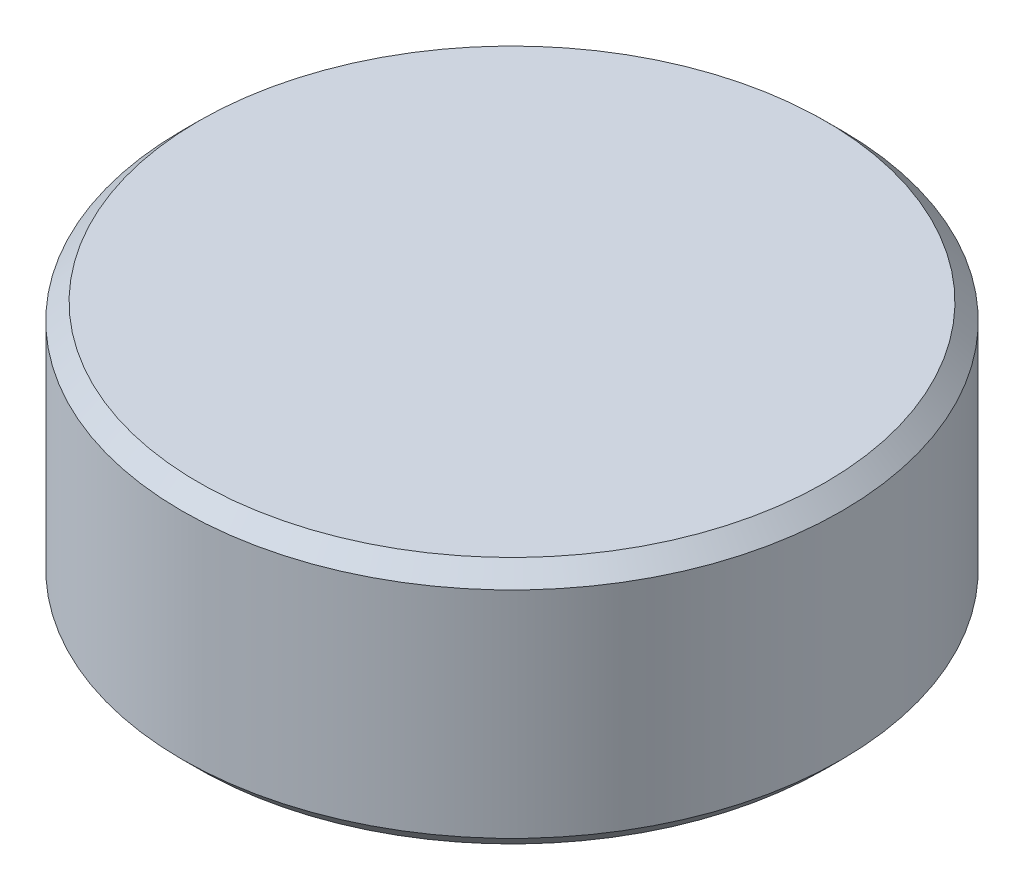
ISO-10303-21;
HEADER;
FILE_DESCRIPTION(('STEP AP214'),'2;1');
FILE_NAME('part.step','',(''),(''),'','','');
FILE_SCHEMA(('AUTOMOTIVE_DESIGN { 1 0 10303 214 1 1 1 1 }'));
ENDSEC;
DATA;
#1=APPLICATION_CONTEXT('core data for automotive mechanical design processes');
#2=APPLICATION_PROTOCOL_DEFINITION('international standard','automotive_design',2000,#1);
#3=PRODUCT_CONTEXT('',#1,'mechanical');
#4=PRODUCT('Part','Part','',(#3));
#5=PRODUCT_RELATED_PRODUCT_CATEGORY('part','',(#4));
#6=PRODUCT_DEFINITION_FORMATION('','',#4);
#7=PRODUCT_DEFINITION_CONTEXT('part definition',#1,'design');
#8=PRODUCT_DEFINITION('design','',#6,#7);
#9=PRODUCT_DEFINITION_SHAPE('','',#8);
#10=(LENGTH_UNIT() NAMED_UNIT(*) SI_UNIT(.MILLI.,.METRE.));
#11=(NAMED_UNIT(*) PLANE_ANGLE_UNIT() SI_UNIT($,.RADIAN.));
#12=(NAMED_UNIT(*) SI_UNIT($,.STERADIAN.) SOLID_ANGLE_UNIT());
#13=UNCERTAINTY_MEASURE_WITH_UNIT(LENGTH_MEASURE(1.E-05),#10,'distance_accuracy_value','');
#14=(GEOMETRIC_REPRESENTATION_CONTEXT(3) GLOBAL_UNCERTAINTY_ASSIGNED_CONTEXT((#13)) GLOBAL_UNIT_ASSIGNED_CONTEXT((#10,
#11,#12)) REPRESENTATION_CONTEXT('',''));
#15=CARTESIAN_POINT('',(0.,0.,0.));
#16=DIRECTION('',(0.,0.,1.));
#17=DIRECTION('',(1.,0.,0.));
#18=AXIS2_PLACEMENT_3D('',#15,#16,#17);
#19=CARTESIAN_POINT('',(0.,-5.375,284.8));
#20=DIRECTION('',(0.,-1.,0.));
#21=DIRECTION('',(0.,0.,1.));
#22=AXIS2_PLACEMENT_3D('',#19,#20,#21);
#23=PLANE('',#22);
#24=CARTESIAN_POINT('',(0.,-5.375,284.8));
#25=DIRECTION('',(0.,1.,0.));
#26=DIRECTION('',(1.,0.,0.));
#27=AXIS2_PLACEMENT_3D('',#24,#25,#26);
#28=CIRCLE('',#27,38.);
#29=CARTESIAN_POINT('',(38.,-5.375,284.8));
#30=VERTEX_POINT('',#29);
#31=EDGE_CURVE('E48',#30,#30,#28,.T.);
#32=ORIENTED_EDGE('',*,*,#31,.T.);
#33=EDGE_LOOP('',(#32));
#34=FACE_BOUND('',#33,.T.);
#35=ADVANCED_FACE('F17',(#34),#23,.F.);
#36=CARTESIAN_POINT('',(0.,-35.475,284.8));
#37=DIRECTION('',(0.,-1.,0.));
#38=DIRECTION('',(0.,0.,1.));
#39=AXIS2_PLACEMENT_3D('',#36,#37,#38);
#40=PLANE('',#39);
#41=CARTESIAN_POINT('',(0.,-35.475,284.8));
#42=DIRECTION('',(0.,-1.,0.));
#43=DIRECTION('',(1.,0.,0.));
#44=AXIS2_PLACEMENT_3D('',#41,#42,#43);
#45=CIRCLE('',#44,38.);
#46=CARTESIAN_POINT('',(-38.,-35.475,284.8));
#47=VERTEX_POINT('',#46);
#48=EDGE_CURVE('E28',#47,#47,#45,.T.);
#49=ORIENTED_EDGE('',*,*,#48,.T.);
#50=EDGE_LOOP('',(#49));
#51=FACE_BOUND('',#50,.T.);
#52=ADVANCED_FACE('F81',(#51),#40,.T.);
#53=CARTESIAN_POINT('',(0.,-35.475,284.8));
#54=DIRECTION('',(0.,1.,0.));
#55=DIRECTION('',(-1.,0.,0.));
#56=AXIS2_PLACEMENT_3D('',#53,#54,#55);
#57=CYLINDRICAL_SURFACE('',#56,40.);
#58=CARTESIAN_POINT('',(0.,-7.375,284.8));
#59=DIRECTION('',(0.,-1.,0.));
#60=DIRECTION('',(1.,0.,0.));
#61=AXIS2_PLACEMENT_3D('',#58,#59,#60);
#62=CIRCLE('',#61,40.);
#63=CARTESIAN_POINT('',(40.,-7.375,284.8));
#64=VERTEX_POINT('',#63);
#65=EDGE_CURVE('E21',#64,#64,#62,.T.);
#66=ORIENTED_EDGE('',*,*,#65,.T.);
#67=EDGE_LOOP('',(#66));
#68=FACE_BOUND('',#67,.T.);
#69=CARTESIAN_POINT('',(0.,-33.475,284.8));
#70=DIRECTION('',(0.,1.,0.));
#71=DIRECTION('',(1.,0.,0.));
#72=AXIS2_PLACEMENT_3D('',#69,#70,#71);
#73=CIRCLE('',#72,40.);
#74=CARTESIAN_POINT('',(-40.,-33.475,284.8));
#75=VERTEX_POINT('',#74);
#76=EDGE_CURVE('E11',#75,#75,#73,.T.);
#77=ORIENTED_EDGE('',*,*,#76,.T.);
#78=EDGE_LOOP('',(#77));
#79=FACE_BOUND('',#78,.T.);
#80=ADVANCED_FACE('F56',(#68,#79),#57,.T.);
#81=CARTESIAN_POINT('',(0.,-35.475,284.8));
#82=DIRECTION('',(0.,1.,0.));
#83=DIRECTION('',(-1.,0.,0.));
#84=AXIS2_PLACEMENT_3D('',#81,#82,#83);
#85=CONICAL_SURFACE('',#84,38.,0.785398163397448);
#86=ORIENTED_EDGE('',*,*,#76,.F.);
#87=EDGE_LOOP('',(#86));
#88=FACE_BOUND('',#87,.T.);
#89=ORIENTED_EDGE('',*,*,#48,.F.);
#90=EDGE_LOOP('',(#89));
#91=FACE_BOUND('',#90,.T.);
#92=ADVANCED_FACE('F19',(#88,#91),#85,.T.);
#93=CARTESIAN_POINT('',(0.,-7.375,284.8));
#94=DIRECTION('',(0.,-1.,0.));
#95=DIRECTION('',(1.,0.,0.));
#96=AXIS2_PLACEMENT_3D('',#93,#94,#95);
#97=CONICAL_SURFACE('',#96,40.,0.785398163397448);
#98=ORIENTED_EDGE('',*,*,#65,.F.);
#99=EDGE_LOOP('',(#98));
#100=FACE_BOUND('',#99,.T.);
#101=ORIENTED_EDGE('',*,*,#31,.F.);
#102=EDGE_LOOP('',(#101));
#103=FACE_BOUND('',#102,.T.);
#104=ADVANCED_FACE('F104',(#100,#103),#97,.T.);
#105=CLOSED_SHELL('',(#35,#52,#80,#92,#104));
#106=MANIFOLD_SOLID_BREP('B1',#105);
#107=ADVANCED_BREP_SHAPE_REPRESENTATION('',(#18,#106),#14);
#108=SHAPE_DEFINITION_REPRESENTATION(#9,#107);
ENDSEC;
END-ISO-10303-21;
